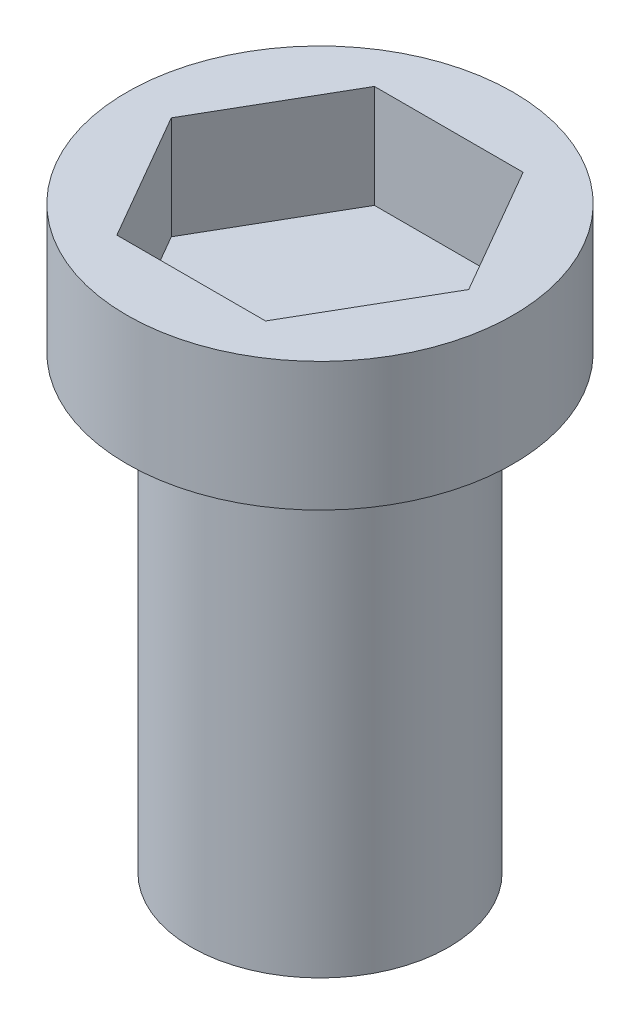
ISO-10303-21;
HEADER;
FILE_DESCRIPTION(('STEP AP214'),'2;1');
FILE_NAME('part.step','',(''),(''),'','','');
FILE_SCHEMA(('AUTOMOTIVE_DESIGN { 1 0 10303 214 1 1 1 1 }'));
ENDSEC;
DATA;
#1=APPLICATION_CONTEXT('core data for automotive mechanical design processes');
#2=APPLICATION_PROTOCOL_DEFINITION('international standard','automotive_design',2000,#1);
#3=PRODUCT_CONTEXT('',#1,'mechanical');
#4=PRODUCT('Part','Part','',(#3));
#5=PRODUCT_RELATED_PRODUCT_CATEGORY('part','',(#4));
#6=PRODUCT_DEFINITION_FORMATION('','',#4);
#7=PRODUCT_DEFINITION_CONTEXT('part definition',#1,'design');
#8=PRODUCT_DEFINITION('design','',#6,#7);
#9=PRODUCT_DEFINITION_SHAPE('','',#8);
#10=(LENGTH_UNIT() NAMED_UNIT(*) SI_UNIT(.MILLI.,.METRE.));
#11=(NAMED_UNIT(*) PLANE_ANGLE_UNIT() SI_UNIT($,.RADIAN.));
#12=(NAMED_UNIT(*) SI_UNIT($,.STERADIAN.) SOLID_ANGLE_UNIT());
#13=UNCERTAINTY_MEASURE_WITH_UNIT(LENGTH_MEASURE(1.E-05),#10,'distance_accuracy_value','');
#14=(GEOMETRIC_REPRESENTATION_CONTEXT(3) GLOBAL_UNCERTAINTY_ASSIGNED_CONTEXT((#13)) GLOBAL_UNIT_ASSIGNED_CONTEXT((#10,
#11,#12)) REPRESENTATION_CONTEXT('',''));
#15=CARTESIAN_POINT('',(0.,0.,0.));
#16=DIRECTION('',(0.,0.,1.));
#17=DIRECTION('',(1.,0.,0.));
#18=AXIS2_PLACEMENT_3D('',#15,#16,#17);
#19=CARTESIAN_POINT('',(11.5470053837925,10.,0.));
#20=DIRECTION('',(-0.866025403784438,0.,0.5));
#21=DIRECTION('',(0.5,0.,0.866025403784438));
#22=AXIS2_PLACEMENT_3D('',#19,#20,#21);
#23=PLANE('',#22);
#24=DIRECTION('',(0.,-1.,0.));
#25=VECTOR('',#24,1.);
#26=CARTESIAN_POINT('',(5.77350269189625,10.,-9.99999999999999));
#27=LINE('',#26,#25);
#28=CARTESIAN_POINT('',(5.77350269189625,10.,-9.99999999999999));
#29=VERTEX_POINT('',#28);
#30=CARTESIAN_POINT('',(5.77350269189625,2.,-9.99999999999999));
#31=VERTEX_POINT('',#30);
#32=EDGE_CURVE('E110',#29,#31,#27,.T.);
#33=ORIENTED_EDGE('',*,*,#32,.T.);
#34=DIRECTION('',(0.5,0.,0.866025403784438));
#35=VECTOR('',#34,1.);
#36=CARTESIAN_POINT('',(11.5470053837925,2.,0.));
#37=LINE('',#36,#35);
#38=CARTESIAN_POINT('',(11.5470053837925,2.,0.));
#39=VERTEX_POINT('',#38);
#40=EDGE_CURVE('E99',#31,#39,#37,.T.);
#41=ORIENTED_EDGE('',*,*,#40,.T.);
#42=DIRECTION('',(0.,-1.,0.));
#43=VECTOR('',#42,1.);
#44=CARTESIAN_POINT('',(11.5470053837925,10.,0.));
#45=LINE('',#44,#43);
#46=CARTESIAN_POINT('',(11.5470053837925,10.,0.));
#47=VERTEX_POINT('',#46);
#48=EDGE_CURVE('E107',#47,#39,#45,.T.);
#49=ORIENTED_EDGE('',*,*,#48,.F.);
#50=DIRECTION('',(-0.5,0.,-0.866025403784438));
#51=VECTOR('',#50,1.);
#52=CARTESIAN_POINT('',(11.5470053837925,10.,0.));
#53=LINE('',#52,#51);
#54=EDGE_CURVE('E112',#47,#29,#53,.T.);
#55=ORIENTED_EDGE('',*,*,#54,.T.);
#56=EDGE_LOOP('',(#33,#41,#49,#55));
#57=FACE_BOUND('',#56,.T.);
#58=ADVANCED_FACE('F45',(#57),#23,.T.);
#59=CARTESIAN_POINT('',(5.77350269189625,10.,-9.99999999999999));
#60=DIRECTION('',(0.,0.,1.));
#61=DIRECTION('',(1.,0.,0.));
#62=AXIS2_PLACEMENT_3D('',#59,#60,#61);
#63=PLANE('',#62);
#64=DIRECTION('',(0.,-1.,0.));
#65=VECTOR('',#64,1.);
#66=CARTESIAN_POINT('',(-5.77350269189626,10.,-9.99999999999999));
#67=LINE('',#66,#65);
#68=CARTESIAN_POINT('',(-5.77350269189626,10.,-9.99999999999999));
#69=VERTEX_POINT('',#68);
#70=CARTESIAN_POINT('',(-5.77350269189626,2.,-9.99999999999999));
#71=VERTEX_POINT('',#70);
#72=EDGE_CURVE('E135',#69,#71,#67,.T.);
#73=ORIENTED_EDGE('',*,*,#72,.T.);
#74=DIRECTION('',(1.,0.,0.));
#75=VECTOR('',#74,1.);
#76=CARTESIAN_POINT('',(5.77350269189625,2.,-9.99999999999999));
#77=LINE('',#76,#75);
#78=EDGE_CURVE('E113',#71,#31,#77,.T.);
#79=ORIENTED_EDGE('',*,*,#78,.T.);
#80=ORIENTED_EDGE('',*,*,#32,.F.);
#81=DIRECTION('',(-1.,0.,0.));
#82=VECTOR('',#81,1.);
#83=CARTESIAN_POINT('',(5.77350269189625,10.,-9.99999999999999));
#84=LINE('',#83,#82);
#85=EDGE_CURVE('E215',#29,#69,#84,.T.);
#86=ORIENTED_EDGE('',*,*,#85,.T.);
#87=EDGE_LOOP('',(#73,#79,#80,#86));
#88=FACE_BOUND('',#87,.T.);
#89=ADVANCED_FACE('F164',(#88),#63,.T.);
#90=CARTESIAN_POINT('',(-5.77350269189626,10.,-9.99999999999999));
#91=DIRECTION('',(0.866025403784438,0.,0.5));
#92=DIRECTION('',(0.5,0.,-0.866025403784439));
#93=AXIS2_PLACEMENT_3D('',#90,#91,#92);
#94=PLANE('',#93);
#95=DIRECTION('',(0.,-1.,0.));
#96=VECTOR('',#95,1.);
#97=CARTESIAN_POINT('',(-11.5470053837925,10.,0.));
#98=LINE('',#97,#96);
#99=CARTESIAN_POINT('',(-11.5470053837925,10.,0.));
#100=VERTEX_POINT('',#99);
#101=CARTESIAN_POINT('',(-11.5470053837925,2.,0.));
#102=VERTEX_POINT('',#101);
#103=EDGE_CURVE('E131',#100,#102,#98,.T.);
#104=ORIENTED_EDGE('',*,*,#103,.T.);
#105=DIRECTION('',(0.5,0.,-0.866025403784439));
#106=VECTOR('',#105,1.);
#107=CARTESIAN_POINT('',(-5.77350269189626,2.,-9.99999999999999));
#108=LINE('',#107,#106);
#109=EDGE_CURVE('E207',#102,#71,#108,.T.);
#110=ORIENTED_EDGE('',*,*,#109,.T.);
#111=ORIENTED_EDGE('',*,*,#72,.F.);
#112=DIRECTION('',(-0.5,0.,0.866025403784439));
#113=VECTOR('',#112,1.);
#114=CARTESIAN_POINT('',(-5.77350269189626,10.,-9.99999999999999));
#115=LINE('',#114,#113);
#116=EDGE_CURVE('E218',#69,#100,#115,.T.);
#117=ORIENTED_EDGE('',*,*,#116,.T.);
#118=EDGE_LOOP('',(#104,#110,#111,#117));
#119=FACE_BOUND('',#118,.T.);
#120=ADVANCED_FACE('F169',(#119),#94,.T.);
#121=CARTESIAN_POINT('',(-11.5470053837925,10.,0.));
#122=DIRECTION('',(0.866025403784438,0.,-0.5));
#123=DIRECTION('',(-0.5,0.,-0.866025403784439));
#124=AXIS2_PLACEMENT_3D('',#121,#122,#123);
#125=PLANE('',#124);
#126=DIRECTION('',(0.,-1.,0.));
#127=VECTOR('',#126,1.);
#128=CARTESIAN_POINT('',(-5.77350269189625,10.,9.99999999999999));
#129=LINE('',#128,#127);
#130=CARTESIAN_POINT('',(-5.77350269189625,10.,9.99999999999999));
#131=VERTEX_POINT('',#130);
#132=CARTESIAN_POINT('',(-5.77350269189625,2.,9.99999999999999));
#133=VERTEX_POINT('',#132);
#134=EDGE_CURVE('E122',#131,#133,#129,.T.);
#135=ORIENTED_EDGE('',*,*,#134,.T.);
#136=DIRECTION('',(-0.5,0.,-0.866025403784439));
#137=VECTOR('',#136,1.);
#138=CARTESIAN_POINT('',(-11.5470053837925,2.,0.));
#139=LINE('',#138,#137);
#140=EDGE_CURVE('E201',#133,#102,#139,.T.);
#141=ORIENTED_EDGE('',*,*,#140,.T.);
#142=ORIENTED_EDGE('',*,*,#103,.F.);
#143=DIRECTION('',(0.5,0.,0.866025403784439));
#144=VECTOR('',#143,1.);
#145=CARTESIAN_POINT('',(-11.5470053837925,10.,0.));
#146=LINE('',#145,#144);
#147=EDGE_CURVE('E221',#100,#131,#146,.T.);
#148=ORIENTED_EDGE('',*,*,#147,.T.);
#149=EDGE_LOOP('',(#135,#141,#142,#148));
#150=FACE_BOUND('',#149,.T.);
#151=ADVANCED_FACE('F175',(#150),#125,.T.);
#152=CARTESIAN_POINT('',(-5.77350269189625,10.,9.99999999999999));
#153=DIRECTION('',(0.,0.,-1.));
#154=DIRECTION('',(-1.,0.,0.));
#155=AXIS2_PLACEMENT_3D('',#152,#153,#154);
#156=PLANE('',#155);
#157=DIRECTION('',(0.,-1.,0.));
#158=VECTOR('',#157,1.);
#159=CARTESIAN_POINT('',(5.77350269189626,10.,9.99999999999999));
#160=LINE('',#159,#158);
#161=CARTESIAN_POINT('',(5.77350269189626,10.,9.99999999999999));
#162=VERTEX_POINT('',#161);
#163=CARTESIAN_POINT('',(5.77350269189626,2.,9.99999999999999));
#164=VERTEX_POINT('',#163);
#165=EDGE_CURVE('E69',#162,#164,#160,.T.);
#166=ORIENTED_EDGE('',*,*,#165,.T.);
#167=DIRECTION('',(-1.,0.,0.));
#168=VECTOR('',#167,1.);
#169=CARTESIAN_POINT('',(-5.77350269189625,2.,9.99999999999999));
#170=LINE('',#169,#168);
#171=EDGE_CURVE('E62',#164,#133,#170,.T.);
#172=ORIENTED_EDGE('',*,*,#171,.T.);
#173=ORIENTED_EDGE('',*,*,#134,.F.);
#174=DIRECTION('',(1.,0.,0.));
#175=VECTOR('',#174,1.);
#176=CARTESIAN_POINT('',(-5.77350269189625,10.,9.99999999999999));
#177=LINE('',#176,#175);
#178=EDGE_CURVE('E124',#131,#162,#177,.T.);
#179=ORIENTED_EDGE('',*,*,#178,.T.);
#180=EDGE_LOOP('',(#166,#172,#173,#179));
#181=FACE_BOUND('',#180,.T.);
#182=ADVANCED_FACE('F179',(#181),#156,.T.);
#183=CARTESIAN_POINT('',(5.77350269189626,10.,9.99999999999999));
#184=DIRECTION('',(-0.866025403784439,0.,-0.5));
#185=DIRECTION('',(-0.5,0.,0.866025403784439));
#186=AXIS2_PLACEMENT_3D('',#183,#184,#185);
#187=PLANE('',#186);
#188=ORIENTED_EDGE('',*,*,#48,.T.);
#189=DIRECTION('',(-0.5,0.,0.866025403784439));
#190=VECTOR('',#189,1.);
#191=CARTESIAN_POINT('',(5.77350269189626,2.,9.99999999999999));
#192=LINE('',#191,#190);
#193=EDGE_CURVE('E49',#39,#164,#192,.T.);
#194=ORIENTED_EDGE('',*,*,#193,.T.);
#195=ORIENTED_EDGE('',*,*,#165,.F.);
#196=DIRECTION('',(0.5,0.,-0.866025403784439));
#197=VECTOR('',#196,1.);
#198=CARTESIAN_POINT('',(5.77350269189626,10.,9.99999999999999));
#199=LINE('',#198,#197);
#200=EDGE_CURVE('E117',#162,#47,#199,.T.);
#201=ORIENTED_EDGE('',*,*,#200,.T.);
#202=EDGE_LOOP('',(#188,#194,#195,#201));
#203=FACE_BOUND('',#202,.T.);
#204=ADVANCED_FACE('F115',(#203),#187,.T.);
#205=CARTESIAN_POINT('',(0.,10.,0.));
#206=DIRECTION('',(0.,1.,0.));
#207=DIRECTION('',(0.,0.,1.));
#208=AXIS2_PLACEMENT_3D('',#205,#206,#207);
#209=PLANE('',#208);
#210=CARTESIAN_POINT('',(0.,10.,0.));
#211=DIRECTION('',(0.,1.,0.));
#212=DIRECTION('',(0.,0.,1.));
#213=AXIS2_PLACEMENT_3D('',#210,#211,#212);
#214=CIRCLE('',#213,15.);
#215=CARTESIAN_POINT('',(0.,10.,15.));
#216=VERTEX_POINT('',#215);
#217=EDGE_CURVE('E103',#216,#216,#214,.T.);
#218=ORIENTED_EDGE('',*,*,#217,.T.);
#219=EDGE_LOOP('',(#218));
#220=FACE_BOUND('',#219,.T.);
#221=ORIENTED_EDGE('',*,*,#85,.F.);
#222=ORIENTED_EDGE('',*,*,#54,.F.);
#223=ORIENTED_EDGE('',*,*,#200,.F.);
#224=ORIENTED_EDGE('',*,*,#178,.F.);
#225=ORIENTED_EDGE('',*,*,#147,.F.);
#226=ORIENTED_EDGE('',*,*,#116,.F.);
#227=EDGE_LOOP('',(#221,#222,#223,#224,#225,#226));
#228=FACE_BOUND('',#227,.T.);
#229=ADVANCED_FACE('F152',(#220,#228),#209,.T.);
#230=CARTESIAN_POINT('',(0.,0.,0.));
#231=DIRECTION('',(0.,1.,0.));
#232=DIRECTION('',(0.,0.,1.));
#233=AXIS2_PLACEMENT_3D('',#230,#231,#232);
#234=PLANE('',#233);
#235=CARTESIAN_POINT('',(0.,0.,0.));
#236=DIRECTION('',(0.,-1.,0.));
#237=DIRECTION('',(0.,0.,-1.));
#238=AXIS2_PLACEMENT_3D('',#235,#236,#237);
#239=CIRCLE('',#238,10.);
#240=CARTESIAN_POINT('',(0.,0.,-10.));
#241=VERTEX_POINT('',#240);
#242=EDGE_CURVE('E11',#241,#241,#239,.T.);
#243=ORIENTED_EDGE('',*,*,#242,.F.);
#244=EDGE_LOOP('',(#243));
#245=FACE_BOUND('',#244,.T.);
#246=CARTESIAN_POINT('',(0.,0.,0.));
#247=DIRECTION('',(0.,1.,0.));
#248=DIRECTION('',(0.,0.,1.));
#249=AXIS2_PLACEMENT_3D('',#246,#247,#248);
#250=CIRCLE('',#249,15.);
#251=CARTESIAN_POINT('',(0.,0.,15.));
#252=VERTEX_POINT('',#251);
#253=EDGE_CURVE('E141',#252,#252,#250,.T.);
#254=ORIENTED_EDGE('',*,*,#253,.F.);
#255=EDGE_LOOP('',(#254));
#256=FACE_BOUND('',#255,.T.);
#257=ADVANCED_FACE('F150',(#245,#256),#234,.F.);
#258=CARTESIAN_POINT('',(0.,10.,0.));
#259=DIRECTION('',(0.,-1.,0.));
#260=DIRECTION('',(0.,0.,-1.));
#261=AXIS2_PLACEMENT_3D('',#258,#259,#260);
#262=CYLINDRICAL_SURFACE('',#261,15.);
#263=ORIENTED_EDGE('',*,*,#253,.T.);
#264=EDGE_LOOP('',(#263));
#265=FACE_BOUND('',#264,.T.);
#266=ORIENTED_EDGE('',*,*,#217,.F.);
#267=EDGE_LOOP('',(#266));
#268=FACE_BOUND('',#267,.T.);
#269=ADVANCED_FACE('F47',(#265,#268),#262,.T.);
#270=CARTESIAN_POINT('',(0.,2.,0.));
#271=DIRECTION('',(0.,-1.,0.));
#272=DIRECTION('',(0.,0.,-1.));
#273=AXIS2_PLACEMENT_3D('',#270,#271,#272);
#274=PLANE('',#273);
#275=ORIENTED_EDGE('',*,*,#40,.F.);
#276=ORIENTED_EDGE('',*,*,#78,.F.);
#277=ORIENTED_EDGE('',*,*,#109,.F.);
#278=ORIENTED_EDGE('',*,*,#140,.F.);
#279=ORIENTED_EDGE('',*,*,#171,.F.);
#280=ORIENTED_EDGE('',*,*,#193,.F.);
#281=EDGE_LOOP('',(#275,#276,#277,#278,#279,#280));
#282=FACE_BOUND('',#281,.T.);
#283=ADVANCED_FACE('F98',(#282),#274,.F.);
#284=CARTESIAN_POINT('',(0.,-35.,0.));
#285=DIRECTION('',(0.,1.,0.));
#286=DIRECTION('',(0.,0.,1.));
#287=AXIS2_PLACEMENT_3D('',#284,#285,#286);
#288=CYLINDRICAL_SURFACE('',#287,10.);
#289=CARTESIAN_POINT('',(0.,-35.,0.));
#290=DIRECTION('',(0.,-1.,0.));
#291=DIRECTION('',(0.,0.,-1.));
#292=AXIS2_PLACEMENT_3D('',#289,#290,#291);
#293=CIRCLE('',#292,10.);
#294=CARTESIAN_POINT('',(0.,-35.,-10.));
#295=VERTEX_POINT('',#294);
#296=EDGE_CURVE('E197',#295,#295,#293,.T.);
#297=ORIENTED_EDGE('',*,*,#296,.F.);
#298=EDGE_LOOP('',(#297));
#299=FACE_BOUND('',#298,.T.);
#300=ORIENTED_EDGE('',*,*,#242,.T.);
#301=EDGE_LOOP('',(#300));
#302=FACE_BOUND('',#301,.T.);
#303=ADVANCED_FACE('F187',(#299,#302),#288,.T.);
#304=CARTESIAN_POINT('',(0.,-35.,0.));
#305=DIRECTION('',(0.,-1.,0.));
#306=DIRECTION('',(0.,0.,-1.));
#307=AXIS2_PLACEMENT_3D('',#304,#305,#306);
#308=PLANE('',#307);
#309=ORIENTED_EDGE('',*,*,#296,.T.);
#310=EDGE_LOOP('',(#309));
#311=FACE_BOUND('',#310,.T.);
#312=ADVANCED_FACE('F189',(#311),#308,.T.);
#313=CLOSED_SHELL('',(#58,#89,#120,#151,#182,#204,#229,#257,#269,#283,#303,#312));
#314=MANIFOLD_SOLID_BREP('B2',#313);
#315=ADVANCED_BREP_SHAPE_REPRESENTATION('',(#18,#314),#14);
#316=SHAPE_DEFINITION_REPRESENTATION(#9,#315);
ENDSEC;
END-ISO-10303-21;
